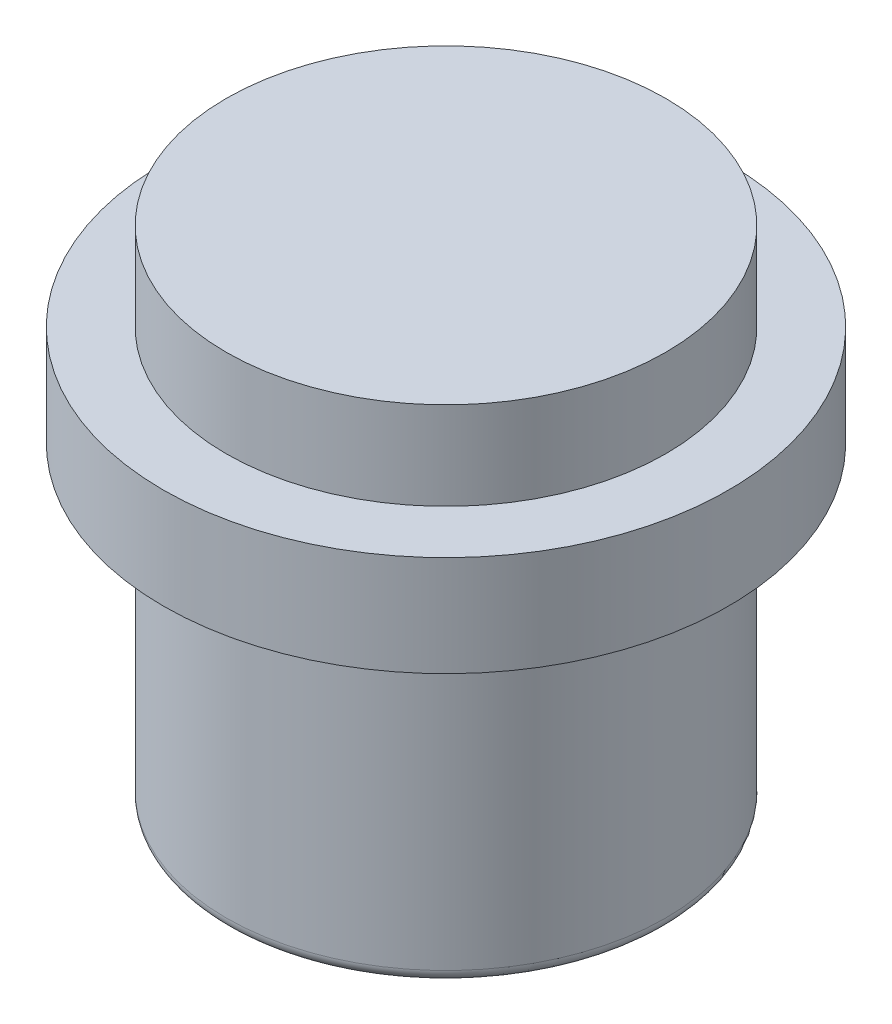
ISO-10303-21;
HEADER;
FILE_DESCRIPTION(('STEP AP214'),'2;1');
FILE_NAME('part.step','',(''),(''),'','','');
FILE_SCHEMA(('AUTOMOTIVE_DESIGN { 1 0 10303 214 1 1 1 1 }'));
ENDSEC;
DATA;
#1=APPLICATION_CONTEXT('core data for automotive mechanical design processes');
#2=APPLICATION_PROTOCOL_DEFINITION('international standard','automotive_design',2000,#1);
#3=PRODUCT_CONTEXT('',#1,'mechanical');
#4=PRODUCT('Part','Part','',(#3));
#5=PRODUCT_RELATED_PRODUCT_CATEGORY('part','',(#4));
#6=PRODUCT_DEFINITION_FORMATION('','',#4);
#7=PRODUCT_DEFINITION_CONTEXT('part definition',#1,'design');
#8=PRODUCT_DEFINITION('design','',#6,#7);
#9=PRODUCT_DEFINITION_SHAPE('','',#8);
#10=(LENGTH_UNIT() NAMED_UNIT(*) SI_UNIT(.MILLI.,.METRE.));
#11=(NAMED_UNIT(*) PLANE_ANGLE_UNIT() SI_UNIT($,.RADIAN.));
#12=(NAMED_UNIT(*) SI_UNIT($,.STERADIAN.) SOLID_ANGLE_UNIT());
#13=UNCERTAINTY_MEASURE_WITH_UNIT(LENGTH_MEASURE(1.E-05),#10,'distance_accuracy_value','');
#14=(GEOMETRIC_REPRESENTATION_CONTEXT(3) GLOBAL_UNCERTAINTY_ASSIGNED_CONTEXT((#13)) GLOBAL_UNIT_ASSIGNED_CONTEXT((#10,
#11,#12)) REPRESENTATION_CONTEXT('',''));
#15=CARTESIAN_POINT('',(0.,0.,0.));
#16=DIRECTION('',(0.,0.,1.));
#17=DIRECTION('',(1.,0.,0.));
#18=AXIS2_PLACEMENT_3D('',#15,#16,#17);
#19=CARTESIAN_POINT('',(-4.113846897925,-17.75,-9.931704974496));
#20=DIRECTION('',(0.,1.,0.));
#21=DIRECTION('',(0.,0.,1.));
#22=AXIS2_PLACEMENT_3D('',#19,#20,#21);
#23=PLANE('',#22);
#24=CARTESIAN_POINT('',(-4.113846897925,-17.75,-9.931704974496));
#25=DIRECTION('',(0.,1.,0.));
#26=DIRECTION('',(0.,0.,1.));
#27=AXIS2_PLACEMENT_3D('',#24,#25,#26);
#28=CIRCLE('',#27,1.75);
#29=CARTESIAN_POINT('',(-4.113846897925,-17.75,-8.181704974496));
#30=VERTEX_POINT('',#29);
#31=EDGE_CURVE('E116',#30,#30,#28,.F.);
#32=ORIENTED_EDGE('',*,*,#31,.F.);
#33=EDGE_LOOP('',(#32));
#34=FACE_BOUND('',#33,.T.);
#35=ADVANCED_FACE('F16',(#34),#23,.T.);
#36=CARTESIAN_POINT('',(-4.113846897925,-17.75,-9.931704974496));
#37=DIRECTION('',(0.,1.,0.));
#38=DIRECTION('',(0.,0.,1.));
#39=AXIS2_PLACEMENT_3D('',#36,#37,#38);
#40=CYLINDRICAL_SURFACE('',#39,1.75);
#41=CARTESIAN_POINT('',(-4.113846897925,-18.45,-9.931704974496));
#42=DIRECTION('',(0.,1.,0.));
#43=DIRECTION('',(0.,0.,1.));
#44=AXIS2_PLACEMENT_3D('',#41,#42,#43);
#45=CIRCLE('',#44,1.75);
#46=CARTESIAN_POINT('',(-4.113846897925,-18.45,-8.181704974496));
#47=VERTEX_POINT('',#46);
#48=EDGE_CURVE('E113',#47,#47,#45,.F.);
#49=ORIENTED_EDGE('',*,*,#48,.F.);
#50=EDGE_LOOP('',(#49));
#51=FACE_BOUND('',#50,.T.);
#52=ORIENTED_EDGE('',*,*,#31,.T.);
#53=EDGE_LOOP('',(#52));
#54=FACE_BOUND('',#53,.T.);
#55=ADVANCED_FACE('F86',(#51,#54),#40,.T.);
#56=CARTESIAN_POINT('',(0.,-18.45,0.));
#57=DIRECTION('',(0.,1.,0.));
#58=DIRECTION('',(0.,0.,1.));
#59=AXIS2_PLACEMENT_3D('',#56,#57,#58);
#60=PLANE('',#59);
#61=ORIENTED_EDGE('',*,*,#48,.T.);
#62=EDGE_LOOP('',(#61));
#63=FACE_BOUND('',#62,.T.);
#64=CARTESIAN_POINT('',(-4.113846897925,-18.45,-9.931704974496));
#65=DIRECTION('',(0.,-1.,0.));
#66=DIRECTION('',(0.,0.,-1.));
#67=AXIS2_PLACEMENT_3D('',#64,#65,#66);
#68=CIRCLE('',#67,2.25);
#69=CARTESIAN_POINT('',(-4.113846897925,-18.45,-12.181704974496));
#70=VERTEX_POINT('',#69);
#71=EDGE_CURVE('E41',#70,#70,#68,.T.);
#72=ORIENTED_EDGE('',*,*,#71,.F.);
#73=EDGE_LOOP('',(#72));
#74=FACE_BOUND('',#73,.T.);
#75=ADVANCED_FACE('F83',(#63,#74),#60,.T.);
#76=CARTESIAN_POINT('',(-4.113846897925,-19.05,-9.931704974496));
#77=DIRECTION('',(0.,-1.,0.));
#78=DIRECTION('',(0.,0.,-1.));
#79=AXIS2_PLACEMENT_3D('',#76,#77,#78);
#80=CYLINDRICAL_SURFACE('',#79,2.25);
#81=CARTESIAN_POINT('',(-4.113846897925,-19.25,-9.931704974496));
#82=DIRECTION('',(0.,-1.,0.));
#83=DIRECTION('',(0.,0.,-1.));
#84=AXIS2_PLACEMENT_3D('',#81,#82,#83);
#85=CIRCLE('',#84,2.25);
#86=CARTESIAN_POINT('',(-4.113846897925,-19.25,-12.181704974496));
#87=VERTEX_POINT('',#86);
#88=EDGE_CURVE('E40',#87,#87,#85,.F.);
#89=ORIENTED_EDGE('',*,*,#88,.T.);
#90=EDGE_LOOP('',(#89));
#91=FACE_BOUND('',#90,.T.);
#92=ORIENTED_EDGE('',*,*,#71,.T.);
#93=EDGE_LOOP('',(#92));
#94=FACE_BOUND('',#93,.T.);
#95=ADVANCED_FACE('F79',(#91,#94),#80,.T.);
#96=CARTESIAN_POINT('',(-4.113846897925,-21.75,-9.931704974496));
#97=DIRECTION('',(0.,-1.,0.));
#98=DIRECTION('',(0.,0.,-1.));
#99=AXIS2_PLACEMENT_3D('',#96,#97,#98);
#100=PLANE('',#99);
#101=CARTESIAN_POINT('',(-4.113846897925,-21.75,-9.931704974496));
#102=DIRECTION('',(0.,1.,0.));
#103=DIRECTION('',(-0.996137225823995,0.,-0.0878101778137116));
#104=AXIS2_PLACEMENT_3D('',#101,#102,#103);
#105=CIRCLE('',#104,1.64999999999977);
#106=CARTESIAN_POINT('',(-5.75747332053433,-21.75,-10.0765917678897));
#107=VERTEX_POINT('',#106);
#108=CARTESIAN_POINT('',(-2.47022047531518,-21.75,-9.78681818110413));
#109=VERTEX_POINT('',#108);
#110=EDGE_CURVE('E38',#107,#109,#105,.T.);
#111=ORIENTED_EDGE('',*,*,#110,.F.);
#112=CARTESIAN_POINT('',(-2.470220475315,-21.75,-9.786818181104));
#113=CARTESIAN_POINT('',(-2.46821288369019,-21.7499999987915,-9.80975759887736));
#114=CARTESIAN_POINT('',(-2.4666816307795,-21.7499999967215,-9.83273868367877));
#115=CARTESIAN_POINT('',(-2.46457329414974,-21.7499999936961,-9.87874311111705));
#116=CARTESIAN_POINT('',(-2.46399614945338,-21.7499999927405,-9.90176645095924));
#117=CARTESIAN_POINT('',(-2.4637972687732,-21.74999999478,-9.94781615732247));
#118=CARTESIAN_POINT('',(-2.46417548725958,-21.7499999977748,-9.97084252364697));
#119=CARTESIAN_POINT('',(-2.46588605131098,-21.7500000005058,-10.0168590675913));
#120=CARTESIAN_POINT('',(-2.46721836691645,-21.7500000002421,-10.0398492463248));
#121=CARTESIAN_POINT('',(-2.47083629098272,-21.7499999870227,-10.0857541561379));
#122=CARTESIAN_POINT('',(-2.47312188500678,-21.7499999740673,-10.1086688883548));
#123=CARTESIAN_POINT('',(-2.4785357328475,-21.7499999038762,-10.1535472638769));
#124=CARTESIAN_POINT('',(-2.4816300682057,-21.7499998482794,-10.1755150102843));
#125=CARTESIAN_POINT('',(-2.4890809348306,-21.7499997086359,-10.2216060700214));
#126=CARTESIAN_POINT('',(-2.49353586404955,-21.7499996222155,-10.2457135939618));
#127=CARTESIAN_POINT('',(-2.50336946212733,-21.749999539137,-10.2928478960542));
#128=CARTESIAN_POINT('',(-2.50870978049212,-21.7499995394049,-10.3158826879191));
#129=CARTESIAN_POINT('',(-2.52039411643546,-21.7499996139746,-10.3616917173865));
#130=CARTESIAN_POINT('',(-2.5267379527053,-21.7499996882629,-10.3844660012603));
#131=CARTESIAN_POINT('',(-2.54105278357698,-21.7499998503582,-10.4317555132386));
#132=CARTESIAN_POINT('',(-2.54911902696328,-21.7499999387803,-10.4562420248493));
#133=CARTESIAN_POINT('',(-2.56534896976584,-21.7500000315122,-10.5019389881516));
#134=CARTESIAN_POINT('',(-2.57338819810866,-21.7500000445369,-10.5231942416094));
#135=CARTESIAN_POINT('',(-2.59244432107271,-21.749999942505,-10.571058726059));
#136=CARTESIAN_POINT('',(-2.60368294009293,-21.7499997923013,-10.5975812738656));
#137=CARTESIAN_POINT('',(-2.62081439906256,-21.7499994974232,-10.6349696193745));
#138=CARTESIAN_POINT('',(-2.62609120085331,-21.7499993986578,-10.6461197220842));
#139=CARTESIAN_POINT('',(-2.64853180012262,-21.74999913286,-10.6921154131585));
#140=CARTESIAN_POINT('',(-2.66687512690511,-21.7499992751177,-10.726397506063));
#141=CARTESIAN_POINT('',(-2.6962190265895,-21.7499994170673,-10.7768937545122));
#142=CARTESIAN_POINT('',(-2.7063436318033,-21.7499994524748,-10.7936279933029));
#143=CARTESIAN_POINT('',(-2.73009077851732,-21.7499995526102,-10.8313335740702));
#144=CARTESIAN_POINT('',(-2.74390218478665,-21.7499996227576,-10.8521869486966));
#145=CARTESIAN_POINT('',(-2.77246106518426,-21.7499997571605,-10.8932362592613));
#146=CARTESIAN_POINT('',(-2.7872084063955,-21.7499998214169,-10.9134322879392));
#147=CARTESIAN_POINT('',(-2.81760945653884,-21.7499999285383,-10.9531274881889));
#148=CARTESIAN_POINT('',(-2.83326302437576,-21.7499999714068,-10.9726267674808));
#149=CARTESIAN_POINT('',(-2.85490919956016,-21.7499999964344,-10.9983582353063));
#150=CARTESIAN_POINT('',(-2.86051649395004,-21.7499999999655,-11.0049175537393));
#151=CARTESIAN_POINT('',(-2.87689395860317,-21.7500000000641,-11.0237795671214));
#152=CARTESIAN_POINT('',(-2.88779431926921,-21.7499999875737,-11.0359696359104));
#153=CARTESIAN_POINT('',(-2.91577281958853,-21.7499999679885,-11.0663676018744));
#154=CARTESIAN_POINT('',(-2.93308139275984,-21.7499999671989,-11.084364047469));
#155=CARTESIAN_POINT('',(-2.96846297594359,-21.7499999798458,-11.1195732511299));
#156=CARTESIAN_POINT('',(-2.98653565677141,-21.7499999932764,-11.1367863401691));
#157=CARTESIAN_POINT('',(-3.0234223163375,-21.7500000006522,-11.170385652899));
#158=CARTESIAN_POINT('',(-3.04223602581043,-21.7499999946046,-11.1867721720908));
#159=CARTESIAN_POINT('',(-3.07042908400836,-21.749999617502,-11.2103098229606));
#160=CARTESIAN_POINT('',(-3.07954958233389,-21.7499994406871,-11.2177726272855));
#161=CARTESIAN_POINT('',(-3.09343414585286,-21.749999295026,-11.2288310818083));
#162=CARTESIAN_POINT('',(-3.0981261854727,-21.7499992666041,-11.232517138235));
#163=CARTESIAN_POINT('',(-3.12238206127119,-21.7499991839525,-11.2513409266463));
#164=CARTESIAN_POINT('',(-3.14229890949192,-21.7499993297796,-11.2660275227293));
#165=CARTESIAN_POINT('',(-3.1793036410157,-21.7499995429619,-11.2920559347396));
#166=CARTESIAN_POINT('',(-3.19629219575572,-21.7499996194766,-11.303539965135));
#167=CARTESIAN_POINT('',(-3.23057393794718,-21.7499997612035,-11.3257884560652));
#168=CARTESIAN_POINT('',(-3.24786435230559,-21.7499998264873,-11.3365571896218));
#169=CARTESIAN_POINT('',(-3.28820104230089,-21.7499999402252,-11.3606578583819));
#170=CARTESIAN_POINT('',(-3.31138464428548,-21.7499999773582,-11.3737616551612));
#171=CARTESIAN_POINT('',(-3.33895910040713,-21.7499999950478,-11.3884737046806));
#172=CARTESIAN_POINT('',(-3.34305770454583,-21.7499999970022,-11.3906382007072));
#173=CARTESIAN_POINT('',(-3.35542728948784,-21.7500000007338,-11.3971096293607));
#174=CARTESIAN_POINT('',(-3.36372364046619,-21.7500000003305,-11.401368215967));
#175=CARTESIAN_POINT('',(-3.39287171169759,-21.7499999991174,-11.4160219406776));
#176=CARTESIAN_POINT('',(-3.41390920037743,-21.7499999986035,-11.4260505857819));
#177=CARTESIAN_POINT('',(-3.45637708636679,-21.7499999995183,-11.445226372938));
#178=CARTESIAN_POINT('',(-3.47780742080971,-21.7500000009467,-11.4543736545927));
#179=CARTESIAN_POINT('',(-3.52102836518911,-21.7499999895815,-11.4717661614978));
#180=CARTESIAN_POINT('',(-3.54281893017044,-21.7499999767897,-11.4800114983432));
#181=CARTESIAN_POINT('',(-3.58072912591415,-21.7499998672252,-11.4934720748326));
#182=CARTESIAN_POINT('',(-3.59677338153883,-21.7499997943256,-11.4989001298342));
#183=CARTESIAN_POINT('',(-3.61519423331108,-21.7499996992181,-11.5048104890802));
#184=CARTESIAN_POINT('',(-3.61749157206317,-21.7499996871554,-11.5055419139723));
#185=CARTESIAN_POINT('',(-3.63266192471035,-21.7499996192919,-11.5103301909353));
#186=CARTESIAN_POINT('',(-3.64559017497923,-21.7499996174209,-11.5142131230463));
#187=CARTESIAN_POINT('',(-3.67858060643835,-21.7499996327278,-11.5236752633138));
#188=CARTESIAN_POINT('',(-3.69870679206658,-21.7499996607943,-11.529031459734));
#189=CARTESIAN_POINT('',(-3.7462620857669,-21.7499997424258,-11.5407192793436));
#190=CARTESIAN_POINT('',(-3.77377019585099,-21.749999801487,-11.546731449038));
#191=CARTESIAN_POINT('',(-3.83073338139965,-21.7499999083621,-11.5576482364318));
#192=CARTESIAN_POINT('',(-3.86020556474331,-21.7499999552794,-11.5624638452208));
#193=CARTESIAN_POINT('',(-3.90827859324076,-21.7499999894851,-11.569007852217));
#194=CARTESIAN_POINT('',(-3.92681568411146,-21.7499999925278,-11.571216946657));
#195=CARTESIAN_POINT('',(-3.9664956184052,-21.7499999942171,-11.5752821537531));
#196=CARTESIAN_POINT('',(-3.98764777855793,-21.7499999922049,-11.5770485428193));
#197=CARTESIAN_POINT('',(-4.03458863042323,-21.749999981764,-11.5800649647594));
#198=CARTESIAN_POINT('',(-4.06038990962569,-21.7499999720408,-11.5811204764199));
#199=CARTESIAN_POINT('',(-4.11601108050113,-21.7499999196319,-11.5821012849404));
#200=CARTESIAN_POINT('',(-4.14583481685786,-21.749999872077,-11.5818263461693));
#201=CARTESIAN_POINT('',(-4.19740298630853,-21.7499997768696,-11.5799448766752));
#202=CARTESIAN_POINT('',(-4.21916201450703,-21.7499997326866,-11.5787165619653));
#203=CARTESIAN_POINT('',(-4.2632151893246,-21.7499996822493,-11.5753361505153));
#204=CARTESIAN_POINT('',(-4.28550746454074,-21.7499996770795,-11.5731594091481));
#205=CARTESIAN_POINT('',(-4.33096197170597,-21.7499996971371,-11.5677735086996));
#206=CARTESIAN_POINT('',(-4.35411930431242,-21.7499997237126,-11.5645231223253));
#207=CARTESIAN_POINT('',(-4.40392481396902,-21.7499998068535,-11.5564322221584));
#208=CARTESIAN_POINT('',(-4.43054557149244,-21.7499998674989,-11.5514214827463));
#209=CARTESIAN_POINT('',(-4.4783443329762,-21.7499999426477,-11.5412018145335));
#210=CARTESIAN_POINT('',(-4.49957183604743,-21.7499999638408,-11.5362218845005));
#211=CARTESIAN_POINT('',(-4.54425779566709,-21.7499999884664,-11.5248185962666));
#212=CARTESIAN_POINT('',(-4.56769079528977,-21.7499999895654,-11.5182949609057));
#213=CARTESIAN_POINT('',(-4.61409991780416,-21.7499999886597,-11.504278653501));
#214=CARTESIAN_POINT('',(-4.63707800841169,-21.7499999866749,-11.4967924741941));
#215=CARTESIAN_POINT('',(-4.68787792055933,-21.7499999528746,-11.4790235168396));
#216=CARTESIAN_POINT('',(-4.71561338635951,-21.7499999143802,-11.4684918655097));
#217=CARTESIAN_POINT('',(-4.76068048658877,-21.749999779082,-11.4499834239087));
#218=CARTESIAN_POINT('',(-4.77819059881326,-21.7499997080083,-11.4424372364322));
#219=CARTESIAN_POINT('',(-4.8183108694637,-21.7499995468686,-11.4243050074434));
#220=CARTESIAN_POINT('',(-4.8408230147219,-21.749999457729,-11.4135007490993));
#221=CARTESIAN_POINT('',(-4.88532913658767,-21.7499993023506,-11.3908735138748));
#222=CARTESIAN_POINT('',(-4.90732310179939,-21.7499992361124,-11.3790505146167));
#223=CARTESIAN_POINT('',(-4.95074653705869,-21.749999145457,-11.3544091849194));
#224=CARTESIAN_POINT('',(-4.97217600587049,-21.7499991210398,-11.3415908523014));
#225=CARTESIAN_POINT('',(-5.01442492539901,-21.749999119126,-11.3149864440801));
#226=CARTESIAN_POINT('',(-5.03524438684048,-21.7499991416286,-11.3012003855053));
#227=CARTESIAN_POINT('',(-5.07622944537633,-21.7499992282737,-11.2726897507431));
#228=CARTESIAN_POINT('',(-5.09639506687809,-21.7499992924146,-11.2579652096495));
#229=CARTESIAN_POINT('',(-5.13602899500721,-21.7499994471938,-11.2276086015729));
#230=CARTESIAN_POINT('',(-5.15549734142277,-21.7499995378306,-11.2119765865063));
#231=CARTESIAN_POINT('',(-5.19369849425014,-21.7499997150794,-11.17983944923));
#232=CARTESIAN_POINT('',(-5.21243135713682,-21.7499998016918,-11.1633343942868));
#233=CARTESIAN_POINT('',(-5.23977452699283,-21.7499999096668,-11.138098748571));
#234=CARTESIAN_POINT('',(-5.24868248219558,-21.7499999417983,-11.1296885180762));
#235=CARTESIAN_POINT('',(-5.26663236347253,-21.749999977232,-11.112371807322));
#236=CARTESIAN_POINT('',(-5.2756675716276,-21.7499999794549,-11.1034583609031));
#237=CARTESIAN_POINT('',(-5.30214119699959,-21.7500000126764,-11.0767644678234));
#238=CARTESIAN_POINT('',(-5.31929934807457,-21.7500000693072,-11.0587052364839));
#239=CARTESIAN_POINT('',(-5.35033210628875,-21.7499998242138,-11.0246968566163));
#240=CARTESIAN_POINT('',(-5.36431040537442,-21.7499995754712,-11.0088424371258));
#241=CARTESIAN_POINT('',(-5.38997016522992,-21.7499992876487,-10.9784338909166));
#242=CARTESIAN_POINT('',(-5.40172890604029,-21.7499992274276,-10.9639449110025));
#243=CARTESIAN_POINT('',(-5.43778570425887,-21.7499992084944,-10.9178876786142));
#244=CARTESIAN_POINT('',(-5.46117089532773,-21.7499994425243,-10.885596263577));
#245=CARTESIAN_POINT('',(-5.49750363616469,-21.7499996985174,-10.8314085912892));
#246=CARTESIAN_POINT('',(-5.51116379536349,-21.7499997665892,-10.8099835374501));
#247=CARTESIAN_POINT('',(-5.53909086915178,-21.7499998785365,-10.7638783254969));
#248=CARTESIAN_POINT('',(-5.55322889452168,-21.7499999184529,-10.7391196427934));
#249=CARTESIAN_POINT('',(-5.5783296374602,-21.749999965053,-10.6924133277965));
#250=CARTESIAN_POINT('',(-5.58946015027558,-21.7499999755967,-10.6705555274592));
#251=CARTESIAN_POINT('',(-5.60901997886065,-21.7499999870609,-10.6299525943246));
#252=CARTESIAN_POINT('',(-5.61759464349264,-21.7499999892645,-10.6112774407964));
#253=CARTESIAN_POINT('',(-5.63202118985631,-21.7499999843826,-10.5782888866525));
#254=CARTESIAN_POINT('',(-5.63802164236835,-21.7499999794616,-10.5640401344155));
#255=CARTESIAN_POINT('',(-5.65310773864026,-21.7499999538747,-10.5267757466848));
#256=CARTESIAN_POINT('',(-5.66188255946277,-21.7499999255293,-10.5036331255172));
#257=CARTESIAN_POINT('',(-5.67779101041705,-21.7499998792604,-10.4586075115708));
#258=CARTESIAN_POINT('',(-5.68499654729487,-21.749999860746,-10.4367498398632));
#259=CARTESIAN_POINT('',(-5.69848121033287,-21.749999834941,-10.3927503691401));
#260=CARTESIAN_POINT('',(-5.70476033730824,-21.7499998276504,-10.3706085703746));
#261=CARTESIAN_POINT('',(-5.71637923746217,-21.7499998279941,-10.3260802597848));
#262=CARTESIAN_POINT('',(-5.72171902445773,-21.7499998356281,-10.3036937515651));
#263=CARTESIAN_POINT('',(-5.73145020136715,-21.7499998627072,-10.2587162061036));
#264=CARTESIAN_POINT('',(-5.73584161834471,-21.7499998821519,-10.2361251747173));
#265=CARTESIAN_POINT('',(-5.74366804003989,-21.7499999252047,-10.1907790340537));
#266=CARTESIAN_POINT('',(-5.74710308527431,-21.7499999488126,-10.1680239317691));
#267=CARTESIAN_POINT('',(-5.75301108647202,-21.749999985737,-10.1223904766441));
#268=CARTESIAN_POINT('',(-5.755484096497,-21.7499999990539,-10.0995121308025));
#269=CARTESIAN_POINT('',(-5.757473320534,-21.75,-10.07659176789));
#270=B_SPLINE_CURVE_WITH_KNOTS('',3,(#112,#113,#114,#115,#116,#117,#118,#119,#120,#121,#122,
#123,#124,#125,#126,#127,#128,#129,#130,#131,#132,#133,#134,#135,#136,#137,#138,#139,#140,#141,
#142,#143,#144,#145,#146,#147,#148,#149,#150,#151,#152,#153,#154,#155,#156,#157,#158,#159,#160,
#161,#162,#163,#164,#165,#166,#167,#168,#169,#170,#171,#172,#173,#174,#175,#176,#177,#178,#179,
#180,#181,#182,#183,#184,#185,#186,#187,#188,#189,#190,#191,#192,#193,#194,#195,#196,#197,#198,
#199,#200,#201,#202,#203,#204,#205,#206,#207,#208,#209,#210,#211,#212,#213,#214,#215,#216,#217,
#218,#219,#220,#221,#222,#223,#224,#225,#226,#227,#228,#229,#230,#231,#232,#233,#234,#235,#236,
#237,#238,#239,#240,#241,#242,#243,#244,#245,#246,#247,#248,#249,#250,#251,#252,#253,#254,#255,
#256,#257,#258,#259,#260,#261,#262,#263,#264,#265,#266,#267,#268,#269),.UNSPECIFIED.,.F.,.F.,(4,
2,2,2,2,2,2,2,2,2,2,2,2,2,2,2,2,2,2,2,2,2,2,2,2,2,2,2,2,2,2,2,2,2,2,2,2,2,2,2,2,2,2,2,2,2,2,2,2,
2,2,2,2,2,2,2,2,2,2,2,2,2,2,2,2,2,2,2,2,2,2,2,2,2,2,2,2,2,4),(0.,0.069076321755409,
0.138148228654867,0.207216843851907,0.276283290324051,0.345348690871358,0.411885243334964,
0.485406224989413,0.556320567386628,0.627222112071433,0.704532642062328,0.77269518461242,
0.859067685332499,0.896072771645556,1.01258907648352,1.07125728411019,1.1462652265705,
1.22126254049158,1.29624820892619,1.32213576233725,1.37118736637532,1.44606984553305,
1.52092038694423,1.59574397661651,1.6310949368856,1.64899488336619,1.72320202653005,
1.78470684676808,1.84580312268284,1.92565744852314,1.93956256436935,1.96753801885018,
2.03743236812445,2.10731562828739,2.17719023220393,2.22799455637516,2.2352274454477,
2.2757187295096,2.33818409968901,2.42261826482844,2.51216051155219,2.56815648875853,
2.63181822153745,2.7092595127006,2.79868792440937,2.86405266279725,2.93122787751293,
3.00136000683961,3.08258899480959,3.14798518223232,3.22093345105552,3.29341320903024,
3.38236976428369,3.43956095127607,3.5144446294852,3.58932995300824,3.66421544045708,
3.73909961052883,3.81398098200236,3.88885807373478,3.96372940466041,4.00047948455189,
4.03855228919975,4.1132620415558,4.17665534254203,4.23262505709809,4.3521088751203,
4.42831513684834,4.51380724939097,4.58736980446393,4.64900420200316,4.69538140594678,
4.7696049202741,4.83862918449499,4.90765338797776,4.97667657608064,5.04569779420406,
5.11471608779028,5.18373050232393),.UNSPECIFIED.);
#271=EDGE_CURVE('E33',#107,#109,#270,.F.);
#272=ORIENTED_EDGE('',*,*,#271,.T.);
#273=EDGE_LOOP('',(#111,#272));
#274=FACE_BOUND('',#273,.T.);
#275=ADVANCED_FACE('F37',(#274),#100,.T.);
#276=CARTESIAN_POINT('',(-4.113846897925,-19.25,-9.931704974496));
#277=DIRECTION('',(0.,1.,0.));
#278=DIRECTION('',(0.,0.,1.));
#279=AXIS2_PLACEMENT_3D('',#276,#277,#278);
#280=PLANE('',#279);
#281=CARTESIAN_POINT('',(-4.113846897925,-19.25,-9.931704974496));
#282=DIRECTION('',(0.,1.,0.));
#283=DIRECTION('',(0.,0.,1.));
#284=AXIS2_PLACEMENT_3D('',#281,#282,#283);
#285=CIRCLE('',#284,1.75);
#286=CARTESIAN_POINT('',(-4.113846897925,-19.25,-8.181704974496));
#287=VERTEX_POINT('',#286);
#288=EDGE_CURVE('E26',#287,#287,#285,.F.);
#289=ORIENTED_EDGE('',*,*,#288,.F.);
#290=EDGE_LOOP('',(#289));
#291=FACE_BOUND('',#290,.T.);
#292=ORIENTED_EDGE('',*,*,#88,.F.);
#293=EDGE_LOOP('',(#292));
#294=FACE_BOUND('',#293,.T.);
#295=ADVANCED_FACE('F65',(#291,#294),#280,.F.);
#296=CARTESIAN_POINT('',(-4.113846897925,-21.65,-9.931704974496));
#297=DIRECTION('',(0.,1.,0.));
#298=DIRECTION('',(0.986952161967868,0.,-0.161013757135694));
#299=AXIS2_PLACEMENT_3D('',#296,#297,#298);
#300=TOROIDAL_SURFACE('',#299,1.65,0.1);
#301=CARTESIAN_POINT('',(-4.113846897925,-21.65,-9.931704974496));
#302=DIRECTION('',(0.,1.,0.));
#303=DIRECTION('',(0.,0.,1.));
#304=AXIS2_PLACEMENT_3D('',#301,#302,#303);
#305=CIRCLE('',#304,1.75);
#306=CARTESIAN_POINT('',(-4.113846897925,-21.65,-8.181704974496));
#307=VERTEX_POINT('',#306);
#308=EDGE_CURVE('E11',#307,#307,#305,.T.);
#309=ORIENTED_EDGE('',*,*,#308,.F.);
#310=EDGE_LOOP('',(#309));
#311=FACE_BOUND('',#310,.T.);
#312=ORIENTED_EDGE('',*,*,#271,.F.);
#313=ORIENTED_EDGE('',*,*,#110,.T.);
#314=EDGE_LOOP('',(#312,#313));
#315=FACE_BOUND('',#314,.T.);
#316=ADVANCED_FACE('F45',(#311,#315),#300,.T.);
#317=CARTESIAN_POINT('',(-4.113846897925,-21.75,-9.931704974496));
#318=DIRECTION('',(0.,1.,0.));
#319=DIRECTION('',(0.,0.,1.));
#320=AXIS2_PLACEMENT_3D('',#317,#318,#319);
#321=CYLINDRICAL_SURFACE('',#320,1.75);
#322=ORIENTED_EDGE('',*,*,#288,.T.);
#323=EDGE_LOOP('',(#322));
#324=FACE_BOUND('',#323,.T.);
#325=ORIENTED_EDGE('',*,*,#308,.T.);
#326=EDGE_LOOP('',(#325));
#327=FACE_BOUND('',#326,.T.);
#328=ADVANCED_FACE('F64',(#324,#327),#321,.T.);
#329=CLOSED_SHELL('',(#35,#55,#75,#95,#275,#295,#316,#328));
#330=MANIFOLD_SOLID_BREP('B1',#329);
#331=ADVANCED_BREP_SHAPE_REPRESENTATION('',(#18,#330),#14);
#332=SHAPE_DEFINITION_REPRESENTATION(#9,#331);
ENDSEC;
END-ISO-10303-21;
